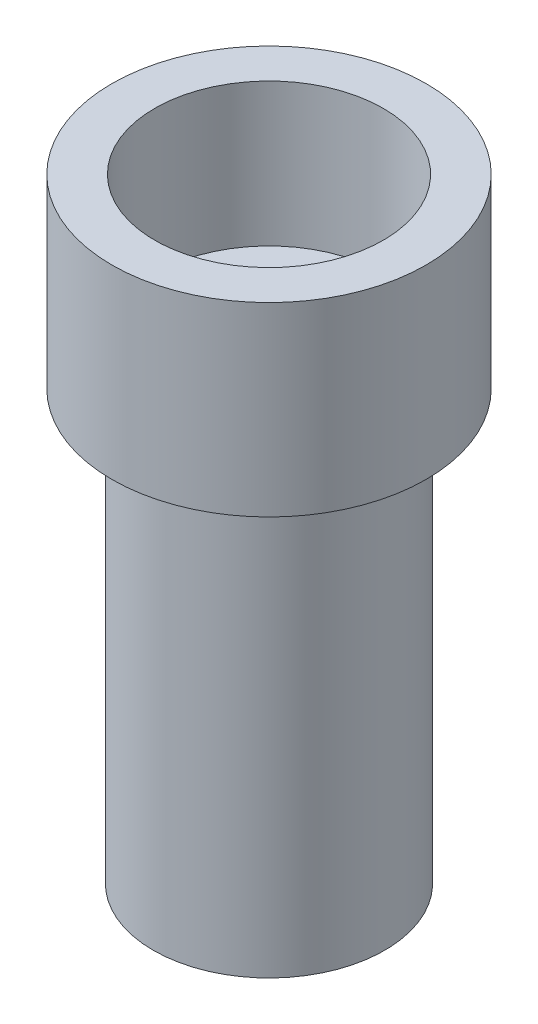
ISO-10303-21;
HEADER;
FILE_DESCRIPTION(('STEP AP214'),'2;1');
FILE_NAME('part.step','',(''),(''),'','','');
FILE_SCHEMA(('AUTOMOTIVE_DESIGN { 1 0 10303 214 1 1 1 1 }'));
ENDSEC;
DATA;
#1=APPLICATION_CONTEXT('core data for automotive mechanical design processes');
#2=APPLICATION_PROTOCOL_DEFINITION('international standard','automotive_design',2000,#1);
#3=PRODUCT_CONTEXT('',#1,'mechanical');
#4=PRODUCT('Part','Part','',(#3));
#5=PRODUCT_RELATED_PRODUCT_CATEGORY('part','',(#4));
#6=PRODUCT_DEFINITION_FORMATION('','',#4);
#7=PRODUCT_DEFINITION_CONTEXT('part definition',#1,'design');
#8=PRODUCT_DEFINITION('design','',#6,#7);
#9=PRODUCT_DEFINITION_SHAPE('','',#8);
#10=(LENGTH_UNIT() NAMED_UNIT(*) SI_UNIT(.MILLI.,.METRE.));
#11=(NAMED_UNIT(*) PLANE_ANGLE_UNIT() SI_UNIT($,.RADIAN.));
#12=(NAMED_UNIT(*) SI_UNIT($,.STERADIAN.) SOLID_ANGLE_UNIT());
#13=UNCERTAINTY_MEASURE_WITH_UNIT(LENGTH_MEASURE(1.E-05),#10,'distance_accuracy_value','');
#14=(GEOMETRIC_REPRESENTATION_CONTEXT(3) GLOBAL_UNCERTAINTY_ASSIGNED_CONTEXT((#13)) GLOBAL_UNIT_ASSIGNED_CONTEXT((#10,
#11,#12)) REPRESENTATION_CONTEXT('',''));
#15=CARTESIAN_POINT('',(0.,0.,0.));
#16=DIRECTION('',(0.,0.,1.));
#17=DIRECTION('',(1.,0.,0.));
#18=AXIS2_PLACEMENT_3D('',#15,#16,#17);
#19=CARTESIAN_POINT('',(0.,0.,0.));
#20=DIRECTION('',(0.,-1.,0.));
#21=DIRECTION('',(0.,0.,-1.));
#22=AXIS2_PLACEMENT_3D('',#19,#20,#21);
#23=CYLINDRICAL_SURFACE('',#22,4.);
#24=CARTESIAN_POINT('',(0.,16.5,0.));
#25=DIRECTION('',(0.,-1.,0.));
#26=DIRECTION('',(0.,0.,-1.));
#27=AXIS2_PLACEMENT_3D('',#24,#25,#26);
#28=CIRCLE('',#27,4.);
#29=CARTESIAN_POINT('',(0.,16.5,-4.));
#30=VERTEX_POINT('',#29);
#31=EDGE_CURVE('E53',#30,#30,#28,.T.);
#32=ORIENTED_EDGE('',*,*,#31,.T.);
#33=EDGE_LOOP('',(#32));
#34=FACE_BOUND('',#33,.T.);
#35=CARTESIAN_POINT('',(0.,21.5,0.));
#36=DIRECTION('',(0.,-1.,0.));
#37=DIRECTION('',(0.,0.,-1.));
#38=AXIS2_PLACEMENT_3D('',#35,#36,#37);
#39=CIRCLE('',#38,4.);
#40=CARTESIAN_POINT('',(0.,21.5,-4.));
#41=VERTEX_POINT('',#40);
#42=EDGE_CURVE('E10',#41,#41,#39,.T.);
#43=ORIENTED_EDGE('',*,*,#42,.F.);
#44=EDGE_LOOP('',(#43));
#45=FACE_BOUND('',#44,.T.);
#46=ADVANCED_FACE('F31',(#34,#45),#23,.F.);
#47=CARTESIAN_POINT('',(4.,21.5,0.));
#48=DIRECTION('',(0.,1.,0.));
#49=DIRECTION('',(0.,0.,1.));
#50=AXIS2_PLACEMENT_3D('',#47,#48,#49);
#51=PLANE('',#50);
#52=ORIENTED_EDGE('',*,*,#42,.T.);
#53=EDGE_LOOP('',(#52));
#54=FACE_BOUND('',#53,.T.);
#55=CARTESIAN_POINT('',(0.,21.5,0.));
#56=DIRECTION('',(0.,-1.,0.));
#57=DIRECTION('',(0.,0.,-1.));
#58=AXIS2_PLACEMENT_3D('',#55,#56,#57);
#59=CIRCLE('',#58,5.5);
#60=CARTESIAN_POINT('',(0.,21.5,-5.5));
#61=VERTEX_POINT('',#60);
#62=EDGE_CURVE('E37',#61,#61,#59,.T.);
#63=ORIENTED_EDGE('',*,*,#62,.F.);
#64=EDGE_LOOP('',(#63));
#65=FACE_BOUND('',#64,.T.);
#66=ADVANCED_FACE('F70',(#54,#65),#51,.T.);
#67=CARTESIAN_POINT('',(0.,0.,0.));
#68=DIRECTION('',(0.,-1.,0.));
#69=DIRECTION('',(0.,0.,-1.));
#70=AXIS2_PLACEMENT_3D('',#67,#68,#69);
#71=CYLINDRICAL_SURFACE('',#70,5.5);
#72=ORIENTED_EDGE('',*,*,#62,.T.);
#73=EDGE_LOOP('',(#72));
#74=FACE_BOUND('',#73,.T.);
#75=CARTESIAN_POINT('',(0.,15.,0.));
#76=DIRECTION('',(0.,-1.,0.));
#77=DIRECTION('',(0.,0.,-1.));
#78=AXIS2_PLACEMENT_3D('',#75,#76,#77);
#79=CIRCLE('',#78,5.5);
#80=CARTESIAN_POINT('',(0.,15.,-5.5));
#81=VERTEX_POINT('',#80);
#82=EDGE_CURVE('E41',#81,#81,#79,.T.);
#83=ORIENTED_EDGE('',*,*,#82,.F.);
#84=EDGE_LOOP('',(#83));
#85=FACE_BOUND('',#84,.T.);
#86=ADVANCED_FACE('F74',(#74,#85),#71,.T.);
#87=CARTESIAN_POINT('',(5.5,15.,0.));
#88=DIRECTION('',(0.,-1.,0.));
#89=DIRECTION('',(0.,0.,-1.));
#90=AXIS2_PLACEMENT_3D('',#87,#88,#89);
#91=PLANE('',#90);
#92=ORIENTED_EDGE('',*,*,#82,.T.);
#93=EDGE_LOOP('',(#92));
#94=FACE_BOUND('',#93,.T.);
#95=CARTESIAN_POINT('',(0.,15.,0.));
#96=DIRECTION('',(0.,-1.,0.));
#97=DIRECTION('',(0.,0.,-1.));
#98=AXIS2_PLACEMENT_3D('',#95,#96,#97);
#99=CIRCLE('',#98,4.05);
#100=CARTESIAN_POINT('',(0.,15.,-4.05));
#101=VERTEX_POINT('',#100);
#102=EDGE_CURVE('E45',#101,#101,#99,.T.);
#103=ORIENTED_EDGE('',*,*,#102,.F.);
#104=EDGE_LOOP('',(#103));
#105=FACE_BOUND('',#104,.T.);
#106=ADVANCED_FACE('F78',(#94,#105),#91,.T.);
#107=CARTESIAN_POINT('',(0.,0.,0.));
#108=DIRECTION('',(0.,-1.,0.));
#109=DIRECTION('',(0.,0.,-1.));
#110=AXIS2_PLACEMENT_3D('',#107,#108,#109);
#111=CYLINDRICAL_SURFACE('',#110,4.05);
#112=ORIENTED_EDGE('',*,*,#102,.T.);
#113=EDGE_LOOP('',(#112));
#114=FACE_BOUND('',#113,.T.);
#115=CARTESIAN_POINT('',(0.,0.,0.));
#116=DIRECTION('',(0.,-1.,0.));
#117=DIRECTION('',(0.,0.,-1.));
#118=AXIS2_PLACEMENT_3D('',#115,#116,#117);
#119=CIRCLE('',#118,4.05);
#120=CARTESIAN_POINT('',(0.,0.,-4.05));
#121=VERTEX_POINT('',#120);
#122=EDGE_CURVE('E50',#121,#121,#119,.T.);
#123=ORIENTED_EDGE('',*,*,#122,.F.);
#124=EDGE_LOOP('',(#123));
#125=FACE_BOUND('',#124,.T.);
#126=ADVANCED_FACE('F66',(#114,#125),#111,.T.);
#127=CARTESIAN_POINT('',(4.05,0.,0.));
#128=DIRECTION('',(0.,-1.,0.));
#129=DIRECTION('',(0.,0.,-1.));
#130=AXIS2_PLACEMENT_3D('',#127,#128,#129);
#131=PLANE('',#130);
#132=ORIENTED_EDGE('',*,*,#122,.T.);
#133=EDGE_LOOP('',(#132));
#134=FACE_BOUND('',#133,.T.);
#135=ADVANCED_FACE('F61',(#134),#131,.T.);
#136=CARTESIAN_POINT('',(0.,16.5,0.));
#137=DIRECTION('',(0.,1.,0.));
#138=DIRECTION('',(0.,0.,1.));
#139=AXIS2_PLACEMENT_3D('',#136,#137,#138);
#140=PLANE('',#139);
#141=ORIENTED_EDGE('',*,*,#31,.F.);
#142=EDGE_LOOP('',(#141));
#143=FACE_BOUND('',#142,.T.);
#144=ADVANCED_FACE('F59',(#143),#140,.T.);
#145=CLOSED_SHELL('',(#46,#66,#86,#106,#126,#135,#144));
#146=MANIFOLD_SOLID_BREP('B2',#145);
#147=ADVANCED_BREP_SHAPE_REPRESENTATION('',(#18,#146),#14);
#148=SHAPE_DEFINITION_REPRESENTATION(#9,#147);
ENDSEC;
END-ISO-10303-21;
